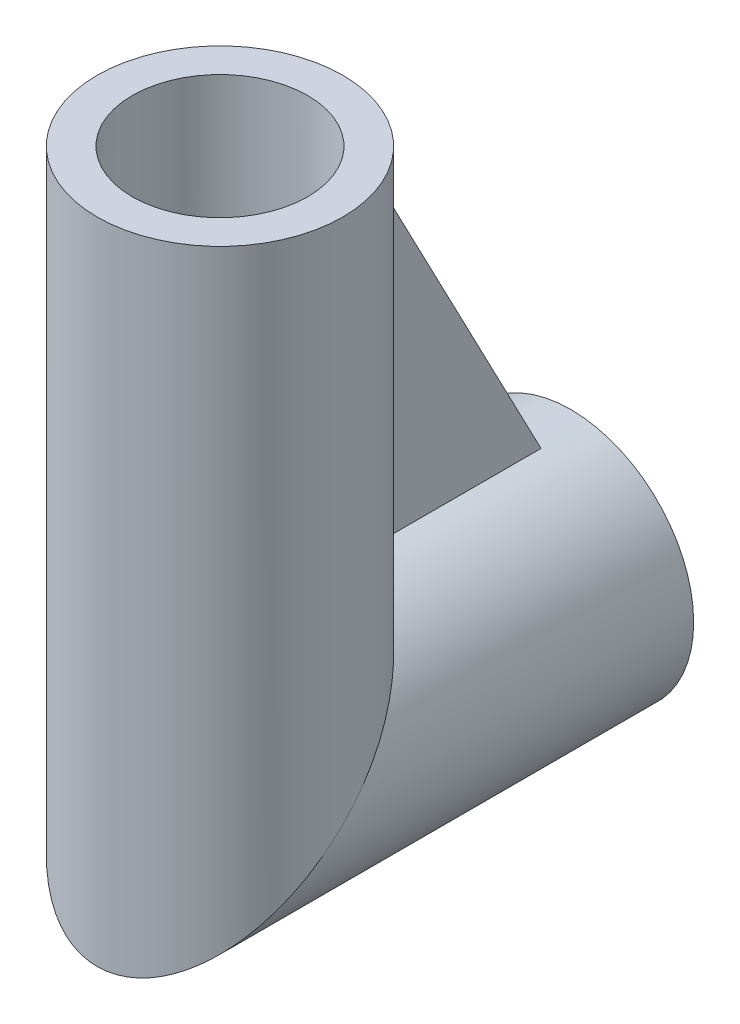
ISO-10303-21;
HEADER;
FILE_DESCRIPTION(('STEP AP214'),'2;1');
FILE_NAME('part.step','',(''),(''),'','','');
FILE_SCHEMA(('AUTOMOTIVE_DESIGN { 1 0 10303 214 1 1 1 1 }'));
ENDSEC;
DATA;
#1=APPLICATION_CONTEXT('core data for automotive mechanical design processes');
#2=APPLICATION_PROTOCOL_DEFINITION('international standard','automotive_design',2000,#1);
#3=PRODUCT_CONTEXT('',#1,'mechanical');
#4=PRODUCT('Part','Part','',(#3));
#5=PRODUCT_RELATED_PRODUCT_CATEGORY('part','',(#4));
#6=PRODUCT_DEFINITION_FORMATION('','',#4);
#7=PRODUCT_DEFINITION_CONTEXT('part definition',#1,'design');
#8=PRODUCT_DEFINITION('design','',#6,#7);
#9=PRODUCT_DEFINITION_SHAPE('','',#8);
#10=(LENGTH_UNIT() NAMED_UNIT(*) SI_UNIT(.MILLI.,.METRE.));
#11=(NAMED_UNIT(*) PLANE_ANGLE_UNIT() SI_UNIT($,.RADIAN.));
#12=(NAMED_UNIT(*) SI_UNIT($,.STERADIAN.) SOLID_ANGLE_UNIT());
#13=UNCERTAINTY_MEASURE_WITH_UNIT(LENGTH_MEASURE(1.E-05),#10,'distance_accuracy_value','');
#14=(GEOMETRIC_REPRESENTATION_CONTEXT(3) GLOBAL_UNCERTAINTY_ASSIGNED_CONTEXT((#13)) GLOBAL_UNIT_ASSIGNED_CONTEXT((#10,
#11,#12)) REPRESENTATION_CONTEXT('',''));
#15=CARTESIAN_POINT('',(0.,0.,0.));
#16=DIRECTION('',(0.,0.,1.));
#17=DIRECTION('',(1.,0.,0.));
#18=AXIS2_PLACEMENT_3D('',#15,#16,#17);
#19=CARTESIAN_POINT('',(0.,-15.5,20.));
#20=DIRECTION('',(0.,1.,0.));
#21=DIRECTION('',(0.,0.,1.));
#22=AXIS2_PLACEMENT_3D('',#19,#20,#21);
#23=CYLINDRICAL_SURFACE('',#22,7.);
#24=DIRECTION('',(0.,1.,0.));
#25=VECTOR('',#24,1.);
#26=CARTESIAN_POINT('',(1.,-15.5,13.0717967697245));
#27=LINE('',#26,#25);
#28=CARTESIAN_POINT('',(1.,26.7636681366035,13.0717967697245));
#29=VERTEX_POINT('',#28);
#30=CARTESIAN_POINT('',(1.,6.92820323027551,13.0717967697245));
#31=VERTEX_POINT('',#30);
#32=EDGE_CURVE('E63',#29,#31,#27,.F.);
#33=ORIENTED_EDGE('',*,*,#32,.F.);
#34=CARTESIAN_POINT('',(0.,40.0150875257842,20.));
#35=DIRECTION('',(0.,-0.463323796795301,0.886189065224338));
#36=DIRECTION('',(0.,0.886189065224338,0.463323796795301));
#37=AXIS2_PLACEMENT_3D('',#34,#35,#36);
#38=ELLIPSE('',#37,15.1082246334363,7.);
#39=CARTESIAN_POINT('',(-1.,26.7636681366035,13.0717967697245));
#40=VERTEX_POINT('',#39);
#41=EDGE_CURVE('E88',#29,#40,#38,.F.);
#42=ORIENTED_EDGE('',*,*,#41,.T.);
#43=DIRECTION('',(0.,1.,0.));
#44=VECTOR('',#43,1.);
#45=CARTESIAN_POINT('',(-1.,-15.5,13.0717967697245));
#46=LINE('',#45,#44);
#47=CARTESIAN_POINT('',(-1.,6.92820323027551,13.0717967697245));
#48=VERTEX_POINT('',#47);
#49=EDGE_CURVE('E74',#40,#48,#46,.F.);
#50=ORIENTED_EDGE('',*,*,#49,.T.);
#51=CARTESIAN_POINT('',(0.,0.,20.));
#52=DIRECTION('',(0.,0.707106781186547,0.707106781186547));
#53=DIRECTION('',(0.,-0.707106781186548,0.707106781186548));
#54=AXIS2_PLACEMENT_3D('',#51,#52,#53);
#55=ELLIPSE('',#54,9.89949493661167,7.);
#56=EDGE_CURVE('E94',#31,#48,#55,.F.);
#57=ORIENTED_EDGE('',*,*,#56,.F.);
#58=EDGE_LOOP('',(#33,#42,#50,#57));
#59=FACE_BOUND('',#58,.T.);
#60=CARTESIAN_POINT('',(0.,30.,20.));
#61=DIRECTION('',(0.,1.,0.));
#62=DIRECTION('',(1.,0.,0.));
#63=AXIS2_PLACEMENT_3D('',#60,#61,#62);
#64=CIRCLE('',#63,7.);
#65=CARTESIAN_POINT('',(7.,30.,20.));
#66=VERTEX_POINT('',#65);
#67=EDGE_CURVE('E98',#66,#66,#64,.T.);
#68=ORIENTED_EDGE('',*,*,#67,.F.);
#69=EDGE_LOOP('',(#68));
#70=FACE_BOUND('',#69,.T.);
#71=ADVANCED_FACE('F41',(#59,#70),#23,.T.);
#72=CARTESIAN_POINT('',(0.,0.,0.));
#73=DIRECTION('',(0.,0.,1.));
#74=DIRECTION('',(1.,0.,0.));
#75=AXIS2_PLACEMENT_3D('',#72,#73,#74);
#76=CYLINDRICAL_SURFACE('',#75,7.);
#77=DIRECTION('',(0.,0.,1.));
#78=VECTOR('',#77,1.);
#79=CARTESIAN_POINT('',(1.,6.92820323027551,0.));
#80=LINE('',#79,#78);
#81=CARTESIAN_POINT('',(1.,6.92820323027551,2.70127509185506));
#82=VERTEX_POINT('',#81);
#83=EDGE_CURVE('E11',#31,#82,#80,.F.);
#84=ORIENTED_EDGE('',*,*,#83,.F.);
#85=ORIENTED_EDGE('',*,*,#56,.T.);
#86=DIRECTION('',(0.,0.,1.));
#87=VECTOR('',#86,1.);
#88=CARTESIAN_POINT('',(-1.,6.92820323027551,0.));
#89=LINE('',#88,#87);
#90=CARTESIAN_POINT('',(-1.,6.92820323027551,2.70127509185506));
#91=VERTEX_POINT('',#90);
#92=EDGE_CURVE('E77',#48,#91,#89,.F.);
#93=ORIENTED_EDGE('',*,*,#92,.T.);
#94=CARTESIAN_POINT('',(0.,0.,-0.920978388341187));
#95=DIRECTION('',(0.,-0.463323796795301,0.886189065224338));
#96=DIRECTION('',(0.,0.886189065224338,0.463323796795301));
#97=AXIS2_PLACEMENT_3D('',#94,#95,#96);
#98=ELLIPSE('',#97,7.89899162006468,7.);
#99=EDGE_CURVE('E49',#91,#82,#98,.F.);
#100=ORIENTED_EDGE('',*,*,#99,.T.);
#101=EDGE_LOOP('',(#84,#85,#93,#100));
#102=FACE_BOUND('',#101,.T.);
#103=CARTESIAN_POINT('',(0.,0.,0.));
#104=DIRECTION('',(0.,0.,1.));
#105=DIRECTION('',(1.,0.,0.));
#106=AXIS2_PLACEMENT_3D('',#103,#104,#105);
#107=CIRCLE('',#106,7.);
#108=CARTESIAN_POINT('',(7.,0.,0.));
#109=VERTEX_POINT('',#108);
#110=EDGE_CURVE('E114',#109,#109,#107,.T.);
#111=ORIENTED_EDGE('',*,*,#110,.T.);
#112=EDGE_LOOP('',(#111));
#113=FACE_BOUND('',#112,.T.);
#114=ADVANCED_FACE('F124',(#102,#113),#76,.T.);
#115=CARTESIAN_POINT('',(0.,30.,20.));
#116=DIRECTION('',(0.,1.,0.));
#117=DIRECTION('',(1.,0.,0.));
#118=AXIS2_PLACEMENT_3D('',#115,#116,#117);
#119=PLANE('',#118);
#120=CARTESIAN_POINT('',(0.,30.,20.));
#121=DIRECTION('',(0.,1.,0.));
#122=DIRECTION('',(1.,0.,0.));
#123=AXIS2_PLACEMENT_3D('',#120,#121,#122);
#124=CIRCLE('',#123,5.);
#125=CARTESIAN_POINT('',(5.,30.,20.));
#126=VERTEX_POINT('',#125);
#127=EDGE_CURVE('E107',#126,#126,#124,.F.);
#128=ORIENTED_EDGE('',*,*,#127,.T.);
#129=EDGE_LOOP('',(#128));
#130=FACE_BOUND('',#129,.T.);
#131=ORIENTED_EDGE('',*,*,#67,.T.);
#132=EDGE_LOOP('',(#131));
#133=FACE_BOUND('',#132,.T.);
#134=ADVANCED_FACE('F152',(#130,#133),#119,.T.);
#135=CARTESIAN_POINT('',(0.,0.,0.));
#136=DIRECTION('',(0.,0.,1.));
#137=DIRECTION('',(1.,0.,0.));
#138=AXIS2_PLACEMENT_3D('',#135,#136,#137);
#139=PLANE('',#138);
#140=CARTESIAN_POINT('',(0.,0.,0.));
#141=DIRECTION('',(0.,0.,1.));
#142=DIRECTION('',(1.,0.,0.));
#143=AXIS2_PLACEMENT_3D('',#140,#141,#142);
#144=CIRCLE('',#143,5.);
#145=CARTESIAN_POINT('',(5.,0.,0.));
#146=VERTEX_POINT('',#145);
#147=EDGE_CURVE('E102',#146,#146,#144,.F.);
#148=ORIENTED_EDGE('',*,*,#147,.F.);
#149=EDGE_LOOP('',(#148));
#150=FACE_BOUND('',#149,.T.);
#151=ORIENTED_EDGE('',*,*,#110,.F.);
#152=EDGE_LOOP('',(#151));
#153=FACE_BOUND('',#152,.T.);
#154=ADVANCED_FACE('F145',(#150,#153),#139,.F.);
#155=CARTESIAN_POINT('',(0.,-11.1,20.));
#156=DIRECTION('',(0.,1.,0.));
#157=DIRECTION('',(0.,0.,1.));
#158=AXIS2_PLACEMENT_3D('',#155,#156,#157);
#159=CYLINDRICAL_SURFACE('',#158,5.);
#160=CARTESIAN_POINT('',(0.,0.,20.));
#161=DIRECTION('',(0.,0.707106781186548,0.707106781186548));
#162=DIRECTION('',(0.,-0.707106781186548,0.707106781186548));
#163=AXIS2_PLACEMENT_3D('',#160,#161,#162);
#164=ELLIPSE('',#163,7.07106781186547,5.);
#165=CARTESIAN_POINT('',(0.,-5.,25.));
#166=VERTEX_POINT('',#165);
#167=EDGE_CURVE('E106',#166,#166,#164,.T.);
#168=ORIENTED_EDGE('',*,*,#167,.F.);
#169=EDGE_LOOP('',(#168));
#170=FACE_BOUND('',#169,.T.);
#171=ORIENTED_EDGE('',*,*,#127,.F.);
#172=EDGE_LOOP('',(#171));
#173=FACE_BOUND('',#172,.T.);
#174=ADVANCED_FACE('F139',(#170,#173),#159,.F.);
#175=CARTESIAN_POINT('',(0.,0.,0.));
#176=DIRECTION('',(0.,0.,1.));
#177=DIRECTION('',(1.,0.,0.));
#178=AXIS2_PLACEMENT_3D('',#175,#176,#177);
#179=CYLINDRICAL_SURFACE('',#178,5.);
#180=ORIENTED_EDGE('',*,*,#147,.T.);
#181=EDGE_LOOP('',(#180));
#182=FACE_BOUND('',#181,.T.);
#183=ORIENTED_EDGE('',*,*,#167,.T.);
#184=EDGE_LOOP('',(#183));
#185=FACE_BOUND('',#184,.T.);
#186=ADVANCED_FACE('F136',(#182,#185),#179,.F.);
#187=CARTESIAN_POINT('',(1.,6.54322886302369,2.5));
#188=DIRECTION('',(0.,-0.463323796795301,0.886189065224338));
#189=DIRECTION('',(0.,-0.886189065224338,-0.463323796795301));
#190=AXIS2_PLACEMENT_3D('',#187,#188,#189);
#191=PLANE('',#190);
#192=ORIENTED_EDGE('',*,*,#41,.F.);
#193=DIRECTION('',(0.,0.886189065224338,0.463323796795301));
#194=VECTOR('',#193,1.);
#195=CARTESIAN_POINT('',(1.,6.54322886302369,2.5));
#196=LINE('',#195,#194);
#197=EDGE_CURVE('E83',#82,#29,#196,.T.);
#198=ORIENTED_EDGE('',*,*,#197,.F.);
#199=ORIENTED_EDGE('',*,*,#99,.F.);
#200=DIRECTION('',(0.,0.886189065224338,0.463323796795301));
#201=VECTOR('',#200,1.);
#202=CARTESIAN_POINT('',(-1.,6.54322886302369,2.5));
#203=LINE('',#202,#201);
#204=EDGE_CURVE('E56',#91,#40,#203,.T.);
#205=ORIENTED_EDGE('',*,*,#204,.T.);
#206=EDGE_LOOP('',(#192,#198,#199,#205));
#207=FACE_BOUND('',#206,.T.);
#208=ADVANCED_FACE('F86',(#207),#191,.F.);
#209=CARTESIAN_POINT('',(1.,0.,0.));
#210=DIRECTION('',(1.,0.,0.));
#211=DIRECTION('',(0.,0.,-1.));
#212=AXIS2_PLACEMENT_3D('',#209,#210,#211);
#213=PLANE('',#212);
#214=ORIENTED_EDGE('',*,*,#197,.T.);
#215=ORIENTED_EDGE('',*,*,#32,.T.);
#216=ORIENTED_EDGE('',*,*,#83,.T.);
#217=EDGE_LOOP('',(#214,#215,#216));
#218=FACE_BOUND('',#217,.T.);
#219=ADVANCED_FACE('F126',(#218),#213,.T.);
#220=CARTESIAN_POINT('',(-1.,0.,0.));
#221=DIRECTION('',(1.,0.,0.));
#222=DIRECTION('',(0.,0.,-1.));
#223=AXIS2_PLACEMENT_3D('',#220,#221,#222);
#224=PLANE('',#223);
#225=ORIENTED_EDGE('',*,*,#49,.F.);
#226=ORIENTED_EDGE('',*,*,#204,.F.);
#227=ORIENTED_EDGE('',*,*,#92,.F.);
#228=EDGE_LOOP('',(#225,#226,#227));
#229=FACE_BOUND('',#228,.T.);
#230=ADVANCED_FACE('F75',(#229),#224,.F.);
#231=CLOSED_SHELL('',(#71,#114,#134,#154,#174,#186,#208,#219,#230));
#232=MANIFOLD_SOLID_BREP('B2',#231);
#233=ADVANCED_BREP_SHAPE_REPRESENTATION('',(#18,#232),#14);
#234=SHAPE_DEFINITION_REPRESENTATION(#9,#233);
ENDSEC;
END-ISO-10303-21;
